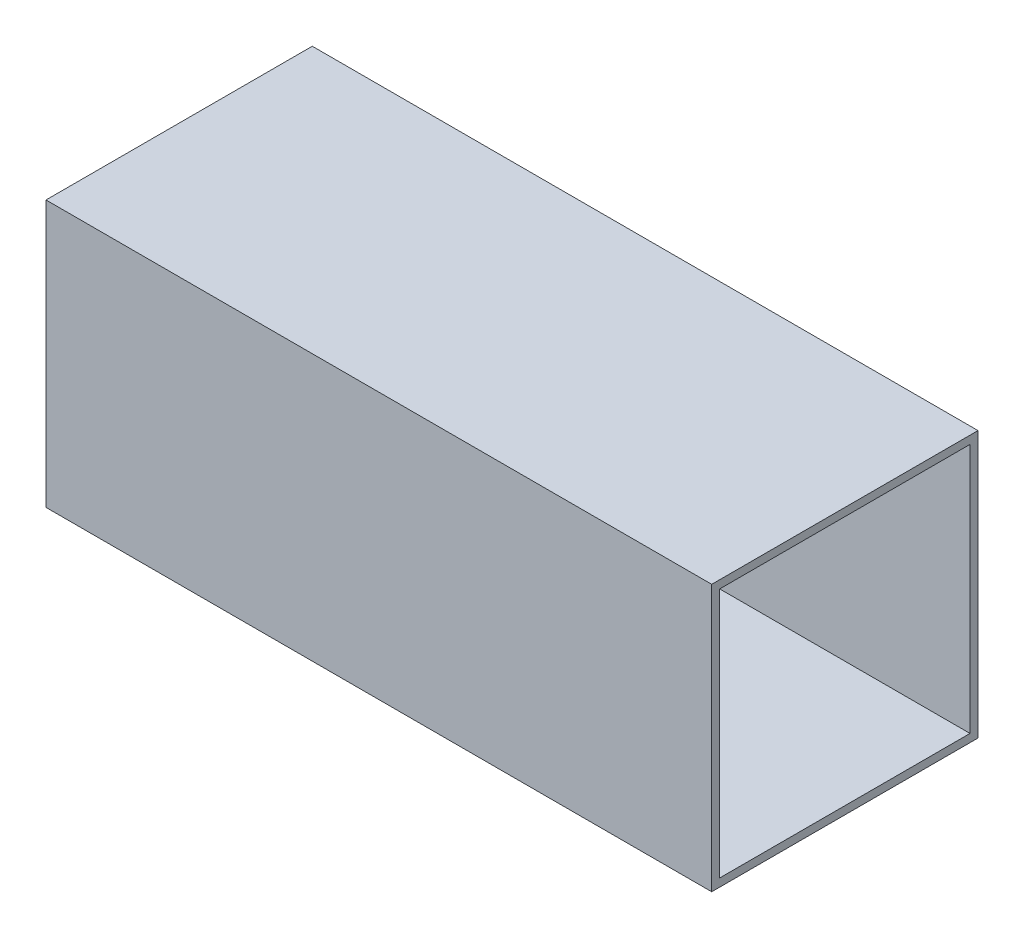
ISO-10303-21;
HEADER;
FILE_DESCRIPTION(('STEP AP214'),'2;1');
FILE_NAME('part.step','',(''),(''),'','','');
FILE_SCHEMA(('AUTOMOTIVE_DESIGN { 1 0 10303 214 1 1 1 1 }'));
ENDSEC;
DATA;
#1=APPLICATION_CONTEXT('core data for automotive mechanical design processes');
#2=APPLICATION_PROTOCOL_DEFINITION('international standard','automotive_design',2000,#1);
#3=PRODUCT_CONTEXT('',#1,'mechanical');
#4=PRODUCT('Part','Part','',(#3));
#5=PRODUCT_RELATED_PRODUCT_CATEGORY('part','',(#4));
#6=PRODUCT_DEFINITION_FORMATION('','',#4);
#7=PRODUCT_DEFINITION_CONTEXT('part definition',#1,'design');
#8=PRODUCT_DEFINITION('design','',#6,#7);
#9=PRODUCT_DEFINITION_SHAPE('','',#8);
#10=(LENGTH_UNIT() NAMED_UNIT(*) SI_UNIT(.MILLI.,.METRE.));
#11=(NAMED_UNIT(*) PLANE_ANGLE_UNIT() SI_UNIT($,.RADIAN.));
#12=(NAMED_UNIT(*) SI_UNIT($,.STERADIAN.) SOLID_ANGLE_UNIT());
#13=UNCERTAINTY_MEASURE_WITH_UNIT(LENGTH_MEASURE(1.E-05),#10,'distance_accuracy_value','');
#14=(GEOMETRIC_REPRESENTATION_CONTEXT(3) GLOBAL_UNCERTAINTY_ASSIGNED_CONTEXT((#13)) GLOBAL_UNIT_ASSIGNED_CONTEXT((#10,
#11,#12)) REPRESENTATION_CONTEXT('',''));
#15=CARTESIAN_POINT('',(0.,0.,0.));
#16=DIRECTION('',(0.,0.,1.));
#17=DIRECTION('',(1.,0.,0.));
#18=AXIS2_PLACEMENT_3D('',#15,#16,#17);
#19=CARTESIAN_POINT('',(0.,0.,97.));
#20=DIRECTION('',(0.,0.,1.));
#21=DIRECTION('',(1.,0.,0.));
#22=AXIS2_PLACEMENT_3D('',#19,#20,#21);
#23=PLANE('',#22);
#24=DIRECTION('',(0.,-1.,0.));
#25=VECTOR('',#24,1.);
#26=CARTESIAN_POINT('',(0.,100.,97.));
#27=LINE('',#26,#25);
#28=CARTESIAN_POINT('',(0.,97.,97.));
#29=VERTEX_POINT('',#28);
#30=CARTESIAN_POINT('',(0.,3.,97.));
#31=VERTEX_POINT('',#30);
#32=EDGE_CURVE('E180',#29,#31,#27,.T.);
#33=ORIENTED_EDGE('',*,*,#32,.F.);
#34=DIRECTION('',(-1.,0.,0.));
#35=VECTOR('',#34,1.);
#36=CARTESIAN_POINT('',(0.,97.,97.));
#37=LINE('',#36,#35);
#38=CARTESIAN_POINT('',(250.,97.,97.));
#39=VERTEX_POINT('',#38);
#40=EDGE_CURVE('E181',#39,#29,#37,.T.);
#41=ORIENTED_EDGE('',*,*,#40,.F.);
#42=DIRECTION('',(0.,1.,0.));
#43=VECTOR('',#42,1.);
#44=CARTESIAN_POINT('',(250.,100.,97.));
#45=LINE('',#44,#43);
#46=CARTESIAN_POINT('',(250.,3.,97.));
#47=VERTEX_POINT('',#46);
#48=EDGE_CURVE('E179',#47,#39,#45,.T.);
#49=ORIENTED_EDGE('',*,*,#48,.F.);
#50=DIRECTION('',(1.,0.,0.));
#51=VECTOR('',#50,1.);
#52=CARTESIAN_POINT('',(0.,3.,97.));
#53=LINE('',#52,#51);
#54=EDGE_CURVE('E176',#31,#47,#53,.T.);
#55=ORIENTED_EDGE('',*,*,#54,.F.);
#56=EDGE_LOOP('',(#33,#41,#49,#55));
#57=FACE_BOUND('',#56,.T.);
#58=DIRECTION('',(-0.945010895201406,-0.327038847769859,0.));
#59=VECTOR('',#58,1.);
#60=CARTESIAN_POINT('',(35.,38.9908729761413,96.99999999998));
#61=LINE('',#60,#59);
#62=CARTESIAN_POINT('',(111.166875619352,65.3498571606297,96.99999999998));
#63=VERTEX_POINT('',#62);
#64=CARTESIAN_POINT('',(35.,38.9908729761413,97.));
#65=VERTEX_POINT('',#64);
#66=EDGE_CURVE('E165',#63,#65,#61,.T.);
#67=ORIENTED_EDGE('',*,*,#66,.T.);
#68=DIRECTION('',(0.961689383531792,-0.274141440869932,0.));
#69=VECTOR('',#68,1.);
#70=CARTESIAN_POINT('',(49.,35.,96.99999999998));
#71=LINE('',#70,#69);
#72=CARTESIAN_POINT('',(49.,35.,96.99999999998));
#73=VERTEX_POINT('',#72);
#74=EDGE_CURVE('E137',#65,#73,#71,.T.);
#75=ORIENTED_EDGE('',*,*,#74,.T.);
#76=DIRECTION('',(1.,0.,0.));
#77=VECTOR('',#76,1.);
#78=CARTESIAN_POINT('',(169.,35.,96.99999999998));
#79=LINE('',#78,#77);
#80=CARTESIAN_POINT('',(169.,35.,97.));
#81=VERTEX_POINT('',#80);
#82=EDGE_CURVE('E170',#73,#81,#79,.T.);
#83=ORIENTED_EDGE('',*,*,#82,.T.);
#84=CARTESIAN_POINT('',(169.,45.,96.99999999998));
#85=DIRECTION('',(0.,0.,1.));
#86=DIRECTION('',(1.,0.,0.));
#87=AXIS2_PLACEMENT_3D('',#84,#85,#86);
#88=CIRCLE('',#87,10.);
#89=CARTESIAN_POINT('',(175.650108959201,52.4683365504476,96.99999999998));
#90=VERTEX_POINT('',#89);
#91=EDGE_CURVE('E57',#81,#90,#88,.T.);
#92=ORIENTED_EDGE('',*,*,#91,.T.);
#93=CARTESIAN_POINT('',(132.424400724393,3.92414897253835,96.99999999998));
#94=DIRECTION('',(0.,0.,1.));
#95=DIRECTION('',(1.,0.,0.));
#96=AXIS2_PLACEMENT_3D('',#93,#94,#95);
#97=CIRCLE('',#96,65.);
#98=EDGE_CURVE('E52',#90,#63,#97,.T.);
#99=ORIENTED_EDGE('',*,*,#98,.T.);
#100=EDGE_LOOP('',(#67,#75,#83,#92,#99));
#101=FACE_BOUND('',#100,.T.);
#102=ADVANCED_FACE('F37',(#57,#101),#23,.F.);
#103=CARTESIAN_POINT('',(0.,0.,3.));
#104=DIRECTION('',(0.,0.,1.));
#105=DIRECTION('',(1.,0.,0.));
#106=AXIS2_PLACEMENT_3D('',#103,#104,#105);
#107=PLANE('',#106);
#108=DIRECTION('',(0.,-1.,0.));
#109=VECTOR('',#108,1.);
#110=CARTESIAN_POINT('',(0.,100.,3.));
#111=LINE('',#110,#109);
#112=CARTESIAN_POINT('',(0.,97.,3.));
#113=VERTEX_POINT('',#112);
#114=CARTESIAN_POINT('',(0.,3.,3.));
#115=VERTEX_POINT('',#114);
#116=EDGE_CURVE('E167',#113,#115,#111,.T.);
#117=ORIENTED_EDGE('',*,*,#116,.T.);
#118=DIRECTION('',(1.,0.,0.));
#119=VECTOR('',#118,1.);
#120=CARTESIAN_POINT('',(0.,3.,3.));
#121=LINE('',#120,#119);
#122=CARTESIAN_POINT('',(250.,3.,3.));
#123=VERTEX_POINT('',#122);
#124=EDGE_CURVE('E173',#115,#123,#121,.T.);
#125=ORIENTED_EDGE('',*,*,#124,.T.);
#126=DIRECTION('',(0.,1.,0.));
#127=VECTOR('',#126,1.);
#128=CARTESIAN_POINT('',(250.,100.,3.));
#129=LINE('',#128,#127);
#130=CARTESIAN_POINT('',(250.,97.,3.));
#131=VERTEX_POINT('',#130);
#132=EDGE_CURVE('E175',#123,#131,#129,.T.);
#133=ORIENTED_EDGE('',*,*,#132,.T.);
#134=DIRECTION('',(-1.,0.,0.));
#135=VECTOR('',#134,1.);
#136=CARTESIAN_POINT('',(0.,97.,3.));
#137=LINE('',#136,#135);
#138=EDGE_CURVE('E185',#131,#113,#137,.T.);
#139=ORIENTED_EDGE('',*,*,#138,.T.);
#140=EDGE_LOOP('',(#117,#125,#133,#139));
#141=FACE_BOUND('',#140,.T.);
#142=DIRECTION('',(0.961689383531792,-0.274141440869932,0.));
#143=VECTOR('',#142,1.);
#144=CARTESIAN_POINT('',(49.,35.,3.));
#145=LINE('',#144,#143);
#146=CARTESIAN_POINT('',(35.,38.9908729761413,3.));
#147=VERTEX_POINT('',#146);
#148=CARTESIAN_POINT('',(49.,35.,3.));
#149=VERTEX_POINT('',#148);
#150=EDGE_CURVE('E135',#147,#149,#145,.T.);
#151=ORIENTED_EDGE('',*,*,#150,.F.);
#152=DIRECTION('',(-0.945010895201406,-0.327038847769859,0.));
#153=VECTOR('',#152,1.);
#154=CARTESIAN_POINT('',(35.,38.9908729761413,3.));
#155=LINE('',#154,#153);
#156=CARTESIAN_POINT('',(111.166875619352,65.3498571606298,3.));
#157=VERTEX_POINT('',#156);
#158=EDGE_CURVE('E143',#157,#147,#155,.T.);
#159=ORIENTED_EDGE('',*,*,#158,.F.);
#160=CARTESIAN_POINT('',(132.424400724393,3.92414897253835,3.));
#161=DIRECTION('',(0.,0.,1.));
#162=DIRECTION('',(-1.,0.,0.));
#163=AXIS2_PLACEMENT_3D('',#160,#161,#162);
#164=CIRCLE('',#163,65.);
#165=CARTESIAN_POINT('',(175.650108959201,52.4683365504475,3.));
#166=VERTEX_POINT('',#165);
#167=EDGE_CURVE('E149',#166,#157,#164,.T.);
#168=ORIENTED_EDGE('',*,*,#167,.F.);
#169=CARTESIAN_POINT('',(169.,45.,3.));
#170=DIRECTION('',(0.,0.,1.));
#171=DIRECTION('',(-1.,0.,0.));
#172=AXIS2_PLACEMENT_3D('',#169,#170,#171);
#173=CIRCLE('',#172,10.);
#174=CARTESIAN_POINT('',(169.,35.,3.));
#175=VERTEX_POINT('',#174);
#176=EDGE_CURVE('E305',#175,#166,#173,.T.);
#177=ORIENTED_EDGE('',*,*,#176,.F.);
#178=DIRECTION('',(1.,0.,0.));
#179=VECTOR('',#178,1.);
#180=CARTESIAN_POINT('',(169.,35.,3.));
#181=LINE('',#180,#179);
#182=EDGE_CURVE('E140',#149,#175,#181,.T.);
#183=ORIENTED_EDGE('',*,*,#182,.F.);
#184=EDGE_LOOP('',(#151,#159,#168,#177,#183));
#185=FACE_BOUND('',#184,.T.);
#186=ADVANCED_FACE('F152',(#141,#185),#107,.T.);
#187=CARTESIAN_POINT('',(0.,100.,100.));
#188=DIRECTION('',(1.,0.,0.));
#189=DIRECTION('',(0.,0.,-1.));
#190=AXIS2_PLACEMENT_3D('',#187,#188,#189);
#191=PLANE('',#190);
#192=DIRECTION('',(0.,-1.,0.));
#193=VECTOR('',#192,1.);
#194=CARTESIAN_POINT('',(0.,100.,0.));
#195=LINE('',#194,#193);
#196=CARTESIAN_POINT('',(0.,100.,0.));
#197=VERTEX_POINT('',#196);
#198=CARTESIAN_POINT('',(0.,0.,0.));
#199=VERTEX_POINT('',#198);
#200=EDGE_CURVE('E199',#197,#199,#195,.T.);
#201=ORIENTED_EDGE('',*,*,#200,.T.);
#202=DIRECTION('',(0.,0.,-1.));
#203=VECTOR('',#202,1.);
#204=CARTESIAN_POINT('',(0.,0.,100.));
#205=LINE('',#204,#203);
#206=CARTESIAN_POINT('',(0.,0.,100.));
#207=VERTEX_POINT('',#206);
#208=EDGE_CURVE('E11',#207,#199,#205,.T.);
#209=ORIENTED_EDGE('',*,*,#208,.F.);
#210=DIRECTION('',(0.,-1.,0.));
#211=VECTOR('',#210,1.);
#212=CARTESIAN_POINT('',(0.,100.,100.));
#213=LINE('',#212,#211);
#214=CARTESIAN_POINT('',(0.,100.,100.));
#215=VERTEX_POINT('',#214);
#216=EDGE_CURVE('E206',#215,#207,#213,.T.);
#217=ORIENTED_EDGE('',*,*,#216,.F.);
#218=DIRECTION('',(0.,0.,-1.));
#219=VECTOR('',#218,1.);
#220=CARTESIAN_POINT('',(0.,100.,100.));
#221=LINE('',#220,#219);
#222=EDGE_CURVE('E216',#215,#197,#221,.T.);
#223=ORIENTED_EDGE('',*,*,#222,.T.);
#224=EDGE_LOOP('',(#201,#209,#217,#223));
#225=FACE_BOUND('',#224,.T.);
#226=ORIENTED_EDGE('',*,*,#116,.F.);
#227=DIRECTION('',(0.,0.,-1.));
#228=VECTOR('',#227,1.);
#229=CARTESIAN_POINT('',(0.,97.,100.));
#230=LINE('',#229,#228);
#231=EDGE_CURVE('E184',#29,#113,#230,.T.);
#232=ORIENTED_EDGE('',*,*,#231,.F.);
#233=ORIENTED_EDGE('',*,*,#32,.T.);
#234=DIRECTION('',(0.,0.,-1.));
#235=VECTOR('',#234,1.);
#236=CARTESIAN_POINT('',(0.,3.,100.));
#237=LINE('',#236,#235);
#238=EDGE_CURVE('E190',#31,#115,#237,.T.);
#239=ORIENTED_EDGE('',*,*,#238,.T.);
#240=EDGE_LOOP('',(#226,#232,#233,#239));
#241=FACE_BOUND('',#240,.T.);
#242=ADVANCED_FACE('F39',(#225,#241),#191,.F.);
#243=CARTESIAN_POINT('',(250.,100.,100.));
#244=DIRECTION('',(-1.,0.,0.));
#245=DIRECTION('',(0.,0.,1.));
#246=AXIS2_PLACEMENT_3D('',#243,#244,#245);
#247=PLANE('',#246);
#248=DIRECTION('',(0.,1.,0.));
#249=VECTOR('',#248,1.);
#250=CARTESIAN_POINT('',(250.,100.,0.));
#251=LINE('',#250,#249);
#252=CARTESIAN_POINT('',(250.,0.,0.));
#253=VERTEX_POINT('',#252);
#254=CARTESIAN_POINT('',(250.,100.,0.));
#255=VERTEX_POINT('',#254);
#256=EDGE_CURVE('E221',#253,#255,#251,.T.);
#257=ORIENTED_EDGE('',*,*,#256,.T.);
#258=DIRECTION('',(0.,0.,-1.));
#259=VECTOR('',#258,1.);
#260=CARTESIAN_POINT('',(250.,100.,100.));
#261=LINE('',#260,#259);
#262=CARTESIAN_POINT('',(250.,100.,100.));
#263=VERTEX_POINT('',#262);
#264=EDGE_CURVE('E226',#263,#255,#261,.T.);
#265=ORIENTED_EDGE('',*,*,#264,.F.);
#266=DIRECTION('',(0.,1.,0.));
#267=VECTOR('',#266,1.);
#268=CARTESIAN_POINT('',(250.,100.,100.));
#269=LINE('',#268,#267);
#270=CARTESIAN_POINT('',(250.,0.,100.));
#271=VERTEX_POINT('',#270);
#272=EDGE_CURVE('E212',#271,#263,#269,.T.);
#273=ORIENTED_EDGE('',*,*,#272,.F.);
#274=DIRECTION('',(0.,0.,-1.));
#275=VECTOR('',#274,1.);
#276=CARTESIAN_POINT('',(250.,0.,100.));
#277=LINE('',#276,#275);
#278=EDGE_CURVE('E45',#271,#253,#277,.T.);
#279=ORIENTED_EDGE('',*,*,#278,.T.);
#280=EDGE_LOOP('',(#257,#265,#273,#279));
#281=FACE_BOUND('',#280,.T.);
#282=ORIENTED_EDGE('',*,*,#132,.F.);
#283=DIRECTION('',(0.,0.,-1.));
#284=VECTOR('',#283,1.);
#285=CARTESIAN_POINT('',(250.,3.,100.));
#286=LINE('',#285,#284);
#287=EDGE_CURVE('E187',#47,#123,#286,.T.);
#288=ORIENTED_EDGE('',*,*,#287,.F.);
#289=ORIENTED_EDGE('',*,*,#48,.T.);
#290=DIRECTION('',(0.,0.,-1.));
#291=VECTOR('',#290,1.);
#292=CARTESIAN_POINT('',(250.,97.,100.));
#293=LINE('',#292,#291);
#294=EDGE_CURVE('E191',#39,#131,#293,.T.);
#295=ORIENTED_EDGE('',*,*,#294,.T.);
#296=EDGE_LOOP('',(#282,#288,#289,#295));
#297=FACE_BOUND('',#296,.T.);
#298=ADVANCED_FACE('F233',(#281,#297),#247,.F.);
#299=CARTESIAN_POINT('',(0.,0.,100.));
#300=DIRECTION('',(0.,1.,0.));
#301=DIRECTION('',(0.,0.,1.));
#302=AXIS2_PLACEMENT_3D('',#299,#300,#301);
#303=PLANE('',#302);
#304=DIRECTION('',(1.,0.,0.));
#305=VECTOR('',#304,1.);
#306=CARTESIAN_POINT('',(0.,0.,0.));
#307=LINE('',#306,#305);
#308=EDGE_CURVE('E219',#199,#253,#307,.T.);
#309=ORIENTED_EDGE('',*,*,#308,.T.);
#310=ORIENTED_EDGE('',*,*,#278,.F.);
#311=DIRECTION('',(1.,0.,0.));
#312=VECTOR('',#311,1.);
#313=CARTESIAN_POINT('',(0.,0.,100.));
#314=LINE('',#313,#312);
#315=EDGE_CURVE('E209',#207,#271,#314,.T.);
#316=ORIENTED_EDGE('',*,*,#315,.F.);
#317=ORIENTED_EDGE('',*,*,#208,.T.);
#318=EDGE_LOOP('',(#309,#310,#316,#317));
#319=FACE_BOUND('',#318,.T.);
#320=ADVANCED_FACE('F251',(#319),#303,.F.);
#321=CARTESIAN_POINT('',(0.,100.,100.));
#322=DIRECTION('',(0.,-1.,0.));
#323=DIRECTION('',(0.,0.,-1.));
#324=AXIS2_PLACEMENT_3D('',#321,#322,#323);
#325=PLANE('',#324);
#326=DIRECTION('',(-1.,0.,0.));
#327=VECTOR('',#326,1.);
#328=CARTESIAN_POINT('',(0.,100.,0.));
#329=LINE('',#328,#327);
#330=EDGE_CURVE('E210',#255,#197,#329,.T.);
#331=ORIENTED_EDGE('',*,*,#330,.T.);
#332=ORIENTED_EDGE('',*,*,#222,.F.);
#333=DIRECTION('',(-1.,0.,0.));
#334=VECTOR('',#333,1.);
#335=CARTESIAN_POINT('',(0.,100.,100.));
#336=LINE('',#335,#334);
#337=EDGE_CURVE('E214',#263,#215,#336,.T.);
#338=ORIENTED_EDGE('',*,*,#337,.F.);
#339=ORIENTED_EDGE('',*,*,#264,.T.);
#340=EDGE_LOOP('',(#331,#332,#338,#339));
#341=FACE_BOUND('',#340,.T.);
#342=ADVANCED_FACE('F243',(#341),#325,.F.);
#343=CARTESIAN_POINT('',(0.,0.,100.));
#344=DIRECTION('',(0.,0.,1.));
#345=DIRECTION('',(1.,0.,0.));
#346=AXIS2_PLACEMENT_3D('',#343,#344,#345);
#347=PLANE('',#346);
#348=ORIENTED_EDGE('',*,*,#216,.T.);
#349=ORIENTED_EDGE('',*,*,#315,.T.);
#350=ORIENTED_EDGE('',*,*,#272,.T.);
#351=ORIENTED_EDGE('',*,*,#337,.T.);
#352=EDGE_LOOP('',(#348,#349,#350,#351));
#353=FACE_BOUND('',#352,.T.);
#354=ADVANCED_FACE('F250',(#353),#347,.T.);
#355=CARTESIAN_POINT('',(0.,0.,0.));
#356=DIRECTION('',(0.,0.,1.));
#357=DIRECTION('',(1.,0.,0.));
#358=AXIS2_PLACEMENT_3D('',#355,#356,#357);
#359=PLANE('',#358);
#360=ORIENTED_EDGE('',*,*,#200,.F.);
#361=ORIENTED_EDGE('',*,*,#330,.F.);
#362=ORIENTED_EDGE('',*,*,#256,.F.);
#363=ORIENTED_EDGE('',*,*,#308,.F.);
#364=EDGE_LOOP('',(#360,#361,#362,#363));
#365=FACE_BOUND('',#364,.T.);
#366=ADVANCED_FACE('F240',(#365),#359,.F.);
#367=CARTESIAN_POINT('',(0.,3.,100.));
#368=DIRECTION('',(0.,1.,0.));
#369=DIRECTION('',(0.,0.,1.));
#370=AXIS2_PLACEMENT_3D('',#367,#368,#369);
#371=PLANE('',#370);
#372=ORIENTED_EDGE('',*,*,#124,.F.);
#373=ORIENTED_EDGE('',*,*,#238,.F.);
#374=ORIENTED_EDGE('',*,*,#54,.T.);
#375=ORIENTED_EDGE('',*,*,#287,.T.);
#376=EDGE_LOOP('',(#372,#373,#374,#375));
#377=FACE_BOUND('',#376,.T.);
#378=ADVANCED_FACE('F274',(#377),#371,.T.);
#379=CARTESIAN_POINT('',(0.,97.,100.));
#380=DIRECTION('',(0.,-1.,0.));
#381=DIRECTION('',(0.,0.,-1.));
#382=AXIS2_PLACEMENT_3D('',#379,#380,#381);
#383=PLANE('',#382);
#384=ORIENTED_EDGE('',*,*,#138,.F.);
#385=ORIENTED_EDGE('',*,*,#294,.F.);
#386=ORIENTED_EDGE('',*,*,#40,.T.);
#387=ORIENTED_EDGE('',*,*,#231,.T.);
#388=EDGE_LOOP('',(#384,#385,#386,#387));
#389=FACE_BOUND('',#388,.T.);
#390=ADVANCED_FACE('F268',(#389),#383,.T.);
#391=CARTESIAN_POINT('',(35.,38.9908729761413,500000.));
#392=DIRECTION('',(0.327038847769859,-0.945010895201406,0.));
#393=DIRECTION('',(0.945010895201406,0.327038847769859,0.));
#394=AXIS2_PLACEMENT_3D('',#391,#392,#393);
#395=PLANE('',#394);
#396=ORIENTED_EDGE('',*,*,#66,.F.);
#397=DIRECTION('',(0.,0.,-1.));
#398=VECTOR('',#397,1.);
#399=CARTESIAN_POINT('',(111.166875619352,65.3498571606298,500000.));
#400=LINE('',#399,#398);
#401=EDGE_CURVE('E139',#63,#157,#400,.T.);
#402=ORIENTED_EDGE('',*,*,#401,.T.);
#403=ORIENTED_EDGE('',*,*,#158,.T.);
#404=DIRECTION('',(0.,0.,-1.));
#405=VECTOR('',#404,1.);
#406=CARTESIAN_POINT('',(35.,38.9908729761413,500000.));
#407=LINE('',#406,#405);
#408=EDGE_CURVE('E130',#65,#147,#407,.T.);
#409=ORIENTED_EDGE('',*,*,#408,.F.);
#410=EDGE_LOOP('',(#396,#402,#403,#409));
#411=FACE_BOUND('',#410,.T.);
#412=ADVANCED_FACE('F144',(#411),#395,.F.);
#413=CARTESIAN_POINT('',(132.424400724393,3.92414897253835,500000.));
#414=DIRECTION('',(0.,0.,-1.));
#415=DIRECTION('',(-1.,0.,0.));
#416=AXIS2_PLACEMENT_3D('',#413,#414,#415);
#417=CYLINDRICAL_SURFACE('',#416,65.);
#418=ORIENTED_EDGE('',*,*,#98,.F.);
#419=DIRECTION('',(0.,0.,-1.));
#420=VECTOR('',#419,1.);
#421=CARTESIAN_POINT('',(175.650108959201,52.4683365504475,500000.));
#422=LINE('',#421,#420);
#423=EDGE_CURVE('E162',#90,#166,#422,.T.);
#424=ORIENTED_EDGE('',*,*,#423,.T.);
#425=ORIENTED_EDGE('',*,*,#167,.T.);
#426=ORIENTED_EDGE('',*,*,#401,.F.);
#427=EDGE_LOOP('',(#418,#424,#425,#426));
#428=FACE_BOUND('',#427,.T.);
#429=ADVANCED_FACE('F290',(#428),#417,.T.);
#430=CARTESIAN_POINT('',(169.,45.,500000.));
#431=DIRECTION('',(0.,0.,-1.));
#432=DIRECTION('',(-1.,0.,0.));
#433=AXIS2_PLACEMENT_3D('',#430,#431,#432);
#434=CYLINDRICAL_SURFACE('',#433,10.);
#435=ORIENTED_EDGE('',*,*,#91,.F.);
#436=DIRECTION('',(0.,0.,-1.));
#437=VECTOR('',#436,1.);
#438=CARTESIAN_POINT('',(169.,35.,500000.));
#439=LINE('',#438,#437);
#440=EDGE_CURVE('E160',#81,#175,#439,.T.);
#441=ORIENTED_EDGE('',*,*,#440,.T.);
#442=ORIENTED_EDGE('',*,*,#176,.T.);
#443=ORIENTED_EDGE('',*,*,#423,.F.);
#444=EDGE_LOOP('',(#435,#441,#442,#443));
#445=FACE_BOUND('',#444,.T.);
#446=ADVANCED_FACE('F287',(#445),#434,.T.);
#447=CARTESIAN_POINT('',(49.,35.,500000.));
#448=DIRECTION('',(0.274141440869932,0.961689383531792,0.));
#449=DIRECTION('',(-0.961689383531792,0.274141440869932,0.));
#450=AXIS2_PLACEMENT_3D('',#447,#448,#449);
#451=PLANE('',#450);
#452=ORIENTED_EDGE('',*,*,#74,.F.);
#453=ORIENTED_EDGE('',*,*,#408,.T.);
#454=ORIENTED_EDGE('',*,*,#150,.T.);
#455=DIRECTION('',(0.,0.,-1.));
#456=VECTOR('',#455,1.);
#457=CARTESIAN_POINT('',(49.,35.,500000.));
#458=LINE('',#457,#456);
#459=EDGE_CURVE('E158',#73,#149,#458,.T.);
#460=ORIENTED_EDGE('',*,*,#459,.F.);
#461=EDGE_LOOP('',(#452,#453,#454,#460));
#462=FACE_BOUND('',#461,.T.);
#463=ADVANCED_FACE('F132',(#462),#451,.F.);
#464=CARTESIAN_POINT('',(169.,35.,500000.));
#465=DIRECTION('',(0.,1.,0.));
#466=DIRECTION('',(-1.,0.,0.));
#467=AXIS2_PLACEMENT_3D('',#464,#465,#466);
#468=PLANE('',#467);
#469=ORIENTED_EDGE('',*,*,#82,.F.);
#470=ORIENTED_EDGE('',*,*,#459,.T.);
#471=ORIENTED_EDGE('',*,*,#182,.T.);
#472=ORIENTED_EDGE('',*,*,#440,.F.);
#473=EDGE_LOOP('',(#469,#470,#471,#472));
#474=FACE_BOUND('',#473,.T.);
#475=ADVANCED_FACE('F283',(#474),#468,.F.);
#476=CLOSED_SHELL('',(#102,#186,#242,#298,#320,#342,#354,#366,#378,#390,#412,#429,#446,#463,#475));
#477=MANIFOLD_SOLID_BREP('B2',#476);
#478=ADVANCED_BREP_SHAPE_REPRESENTATION('',(#18,#477),#14);
#479=SHAPE_DEFINITION_REPRESENTATION(#9,#478);
ENDSEC;
END-ISO-10303-21;
